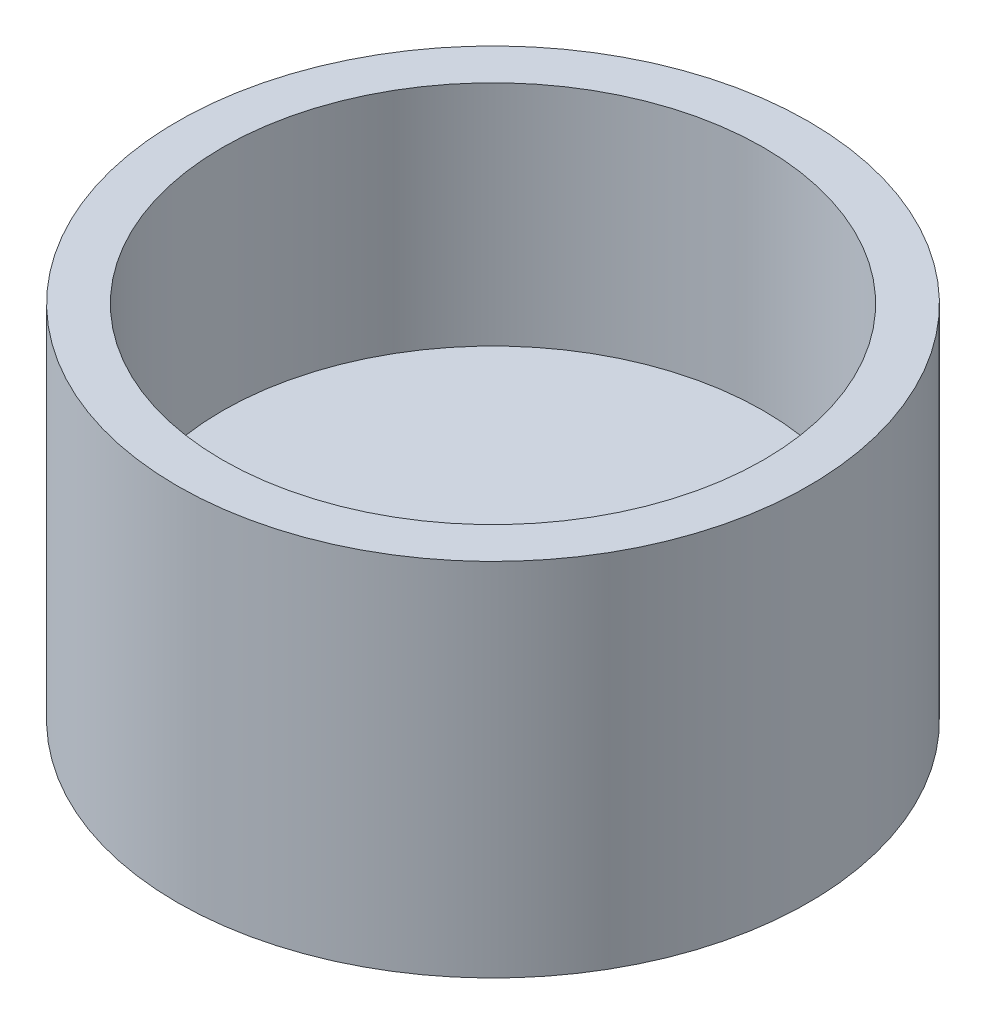
ISO-10303-21;
HEADER;
FILE_DESCRIPTION(('STEP AP214'),'2;1');
FILE_NAME('part.step','',(''),(''),'','','');
FILE_SCHEMA(('AUTOMOTIVE_DESIGN { 1 0 10303 214 1 1 1 1 }'));
ENDSEC;
DATA;
#1=APPLICATION_CONTEXT('core data for automotive mechanical design processes');
#2=APPLICATION_PROTOCOL_DEFINITION('international standard','automotive_design',2000,#1);
#3=PRODUCT_CONTEXT('',#1,'mechanical');
#4=PRODUCT('Part','Part','',(#3));
#5=PRODUCT_RELATED_PRODUCT_CATEGORY('part','',(#4));
#6=PRODUCT_DEFINITION_FORMATION('','',#4);
#7=PRODUCT_DEFINITION_CONTEXT('part definition',#1,'design');
#8=PRODUCT_DEFINITION('design','',#6,#7);
#9=PRODUCT_DEFINITION_SHAPE('','',#8);
#10=(LENGTH_UNIT() NAMED_UNIT(*) SI_UNIT(.MILLI.,.METRE.));
#11=(NAMED_UNIT(*) PLANE_ANGLE_UNIT() SI_UNIT($,.RADIAN.));
#12=(NAMED_UNIT(*) SI_UNIT($,.STERADIAN.) SOLID_ANGLE_UNIT());
#13=UNCERTAINTY_MEASURE_WITH_UNIT(LENGTH_MEASURE(1.E-05),#10,'distance_accuracy_value','');
#14=(GEOMETRIC_REPRESENTATION_CONTEXT(3) GLOBAL_UNCERTAINTY_ASSIGNED_CONTEXT((#13)) GLOBAL_UNIT_ASSIGNED_CONTEXT((#10,
#11,#12)) REPRESENTATION_CONTEXT('',''));
#15=CARTESIAN_POINT('',(0.,0.,0.));
#16=DIRECTION('',(0.,0.,1.));
#17=DIRECTION('',(1.,0.,0.));
#18=AXIS2_PLACEMENT_3D('',#15,#16,#17);
#19=CARTESIAN_POINT('',(0.,0.,0.));
#20=DIRECTION('',(0.,1.,0.));
#21=DIRECTION('',(0.,0.,1.));
#22=AXIS2_PLACEMENT_3D('',#19,#20,#21);
#23=PLANE('',#22);
#24=CARTESIAN_POINT('',(0.,0.,0.));
#25=DIRECTION('',(0.,1.,0.));
#26=DIRECTION('',(0.,0.,1.));
#27=AXIS2_PLACEMENT_3D('',#24,#25,#26);
#28=CIRCLE('',#27,22.225);
#29=CARTESIAN_POINT('',(0.,0.,22.225));
#30=VERTEX_POINT('',#29);
#31=EDGE_CURVE('E45',#30,#30,#28,.T.);
#32=ORIENTED_EDGE('',*,*,#31,.F.);
#33=EDGE_LOOP('',(#32));
#34=FACE_BOUND('',#33,.T.);
#35=DIRECTION('',(-0.452258165067834,0.,-0.89188707364188));
#36=VECTOR('',#35,1.);
#37=CARTESIAN_POINT('',(8.6474883524025,0.,0.470048077395396));
#38=LINE('',#37,#36);
#39=CARTESIAN_POINT('',(8.6474883524025,0.,0.470048077395397));
#40=VERTEX_POINT('',#39);
#41=CARTESIAN_POINT('',(4.7308177522257,0.,-7.2539205534129));
#42=VERTEX_POINT('',#41);
#43=EDGE_CURVE('E52',#40,#42,#38,.T.);
#44=ORIENTED_EDGE('',*,*,#43,.T.);
#45=DIRECTION('',(-0.998525945614747,0.,-0.0542764768032601));
#46=VECTOR('',#45,1.);
#47=CARTESIAN_POINT('',(4.7308177522257,0.,-7.2539205534129));
#48=LINE('',#47,#46);
#49=CARTESIAN_POINT('',(-3.9166706001768,0.,-7.7239686308083));
#50=VERTEX_POINT('',#49);
#51=EDGE_CURVE('E111',#42,#50,#48,.T.);
#52=ORIENTED_EDGE('',*,*,#51,.T.);
#53=DIRECTION('',(-0.546267780546913,0.,0.83761059683862));
#54=VECTOR('',#53,1.);
#55=CARTESIAN_POINT('',(-3.9166706001768,0.,-7.7239686308083));
#56=LINE('',#55,#54);
#57=CARTESIAN_POINT('',(-8.6474883524025,0.,-0.470048077395396));
#58=VERTEX_POINT('',#57);
#59=EDGE_CURVE('E109',#50,#58,#56,.T.);
#60=ORIENTED_EDGE('',*,*,#59,.T.);
#61=DIRECTION('',(0.452258165067834,0.,0.89188707364188));
#62=VECTOR('',#61,1.);
#63=CARTESIAN_POINT('',(-8.6474883524025,0.,-0.470048077395396));
#64=LINE('',#63,#62);
#65=CARTESIAN_POINT('',(-4.7308177522257,0.,7.25392055341291));
#66=VERTEX_POINT('',#65);
#67=EDGE_CURVE('E88',#58,#66,#64,.T.);
#68=ORIENTED_EDGE('',*,*,#67,.T.);
#69=DIRECTION('',(0.998525945614747,0.,0.0542764768032597));
#70=VECTOR('',#69,1.);
#71=CARTESIAN_POINT('',(-4.7308177522257,0.,7.25392055341291));
#72=LINE('',#71,#70);
#73=CARTESIAN_POINT('',(3.9166706001768,0.,7.7239686308083));
#74=VERTEX_POINT('',#73);
#75=EDGE_CURVE('E99',#66,#74,#72,.T.);
#76=ORIENTED_EDGE('',*,*,#75,.T.);
#77=DIRECTION('',(0.546267780546913,0.,-0.83761059683862));
#78=VECTOR('',#77,1.);
#79=CARTESIAN_POINT('',(3.9166706001768,0.,7.7239686308083));
#80=LINE('',#79,#78);
#81=EDGE_CURVE('E105',#74,#40,#80,.T.);
#82=ORIENTED_EDGE('',*,*,#81,.T.);
#83=EDGE_LOOP('',(#44,#52,#60,#68,#76,#82));
#84=FACE_BOUND('',#83,.T.);
#85=ADVANCED_FACE('F37',(#34,#84),#23,.F.);
#86=CARTESIAN_POINT('',(0.,6.35,0.));
#87=DIRECTION('',(0.,-1.,0.));
#88=DIRECTION('',(0.,0.,-1.));
#89=AXIS2_PLACEMENT_3D('',#86,#87,#88);
#90=CYLINDRICAL_SURFACE('',#89,22.225);
#91=ORIENTED_EDGE('',*,*,#31,.T.);
#92=EDGE_LOOP('',(#91));
#93=FACE_BOUND('',#92,.T.);
#94=CARTESIAN_POINT('',(0.,25.4,0.));
#95=DIRECTION('',(0.,1.,0.));
#96=DIRECTION('',(0.,0.,1.));
#97=AXIS2_PLACEMENT_3D('',#94,#95,#96);
#98=CIRCLE('',#97,22.225);
#99=CARTESIAN_POINT('',(0.,25.4,22.225));
#100=VERTEX_POINT('',#99);
#101=EDGE_CURVE('E187',#100,#100,#98,.T.);
#102=ORIENTED_EDGE('',*,*,#101,.F.);
#103=EDGE_LOOP('',(#102));
#104=FACE_BOUND('',#103,.T.);
#105=ADVANCED_FACE('F39',(#93,#104),#90,.T.);
#106=CARTESIAN_POINT('',(8.6474883524025,6.35,0.470048077395396));
#107=DIRECTION('',(-0.89188707364188,0.,0.452258165067834));
#108=DIRECTION('',(0.452258165067834,0.,0.89188707364188));
#109=AXIS2_PLACEMENT_3D('',#106,#107,#108);
#110=PLANE('',#109);
#111=ORIENTED_EDGE('',*,*,#43,.F.);
#112=DIRECTION('',(0.,-1.,0.));
#113=VECTOR('',#112,1.);
#114=CARTESIAN_POINT('',(8.6474883524025,6.35,0.470048077395396));
#115=LINE('',#114,#113);
#116=CARTESIAN_POINT('',(8.6474883524025,6.35,0.470048077395396));
#117=VERTEX_POINT('',#116);
#118=EDGE_CURVE('E116',#117,#40,#115,.T.);
#119=ORIENTED_EDGE('',*,*,#118,.F.);
#120=DIRECTION('',(-0.452258165067834,0.,-0.89188707364188));
#121=VECTOR('',#120,1.);
#122=CARTESIAN_POINT('',(8.6474883524025,6.35,0.470048077395396));
#123=LINE('',#122,#121);
#124=CARTESIAN_POINT('',(4.7308177522257,6.35,-7.2539205534129));
#125=VERTEX_POINT('',#124);
#126=EDGE_CURVE('E61',#117,#125,#123,.T.);
#127=ORIENTED_EDGE('',*,*,#126,.T.);
#128=DIRECTION('',(0.,-1.,0.));
#129=VECTOR('',#128,1.);
#130=CARTESIAN_POINT('',(4.7308177522257,6.35,-7.2539205534129));
#131=LINE('',#130,#129);
#132=EDGE_CURVE('E123',#125,#42,#131,.T.);
#133=ORIENTED_EDGE('',*,*,#132,.T.);
#134=EDGE_LOOP('',(#111,#119,#127,#133));
#135=FACE_BOUND('',#134,.T.);
#136=ADVANCED_FACE('F133',(#135),#110,.T.);
#137=CARTESIAN_POINT('',(4.7308177522257,6.35,-7.2539205534129));
#138=DIRECTION('',(-0.0542764768032601,0.,0.998525945614747));
#139=DIRECTION('',(0.998525945614747,0.,0.0542764768032601));
#140=AXIS2_PLACEMENT_3D('',#137,#138,#139);
#141=PLANE('',#140);
#142=ORIENTED_EDGE('',*,*,#51,.F.);
#143=ORIENTED_EDGE('',*,*,#132,.F.);
#144=DIRECTION('',(-0.998525945614747,0.,-0.0542764768032601));
#145=VECTOR('',#144,1.);
#146=CARTESIAN_POINT('',(4.7308177522257,6.35,-7.2539205534129));
#147=LINE('',#146,#145);
#148=CARTESIAN_POINT('',(-3.9166706001768,6.35,-7.7239686308083));
#149=VERTEX_POINT('',#148);
#150=EDGE_CURVE('E191',#125,#149,#147,.T.);
#151=ORIENTED_EDGE('',*,*,#150,.T.);
#152=DIRECTION('',(0.,-1.,0.));
#153=VECTOR('',#152,1.);
#154=CARTESIAN_POINT('',(-3.9166706001768,6.35,-7.7239686308083));
#155=LINE('',#154,#153);
#156=EDGE_CURVE('E121',#149,#50,#155,.T.);
#157=ORIENTED_EDGE('',*,*,#156,.T.);
#158=EDGE_LOOP('',(#142,#143,#151,#157));
#159=FACE_BOUND('',#158,.T.);
#160=ADVANCED_FACE('F137',(#159),#141,.T.);
#161=CARTESIAN_POINT('',(-3.9166706001768,6.35,-7.7239686308083));
#162=DIRECTION('',(0.83761059683862,0.,0.546267780546913));
#163=DIRECTION('',(0.546267780546913,0.,-0.83761059683862));
#164=AXIS2_PLACEMENT_3D('',#161,#162,#163);
#165=PLANE('',#164);
#166=ORIENTED_EDGE('',*,*,#59,.F.);
#167=ORIENTED_EDGE('',*,*,#156,.F.);
#168=DIRECTION('',(-0.546267780546913,0.,0.83761059683862));
#169=VECTOR('',#168,1.);
#170=CARTESIAN_POINT('',(-3.9166706001768,6.35,-7.7239686308083));
#171=LINE('',#170,#169);
#172=CARTESIAN_POINT('',(-8.6474883524025,6.35,-0.470048077395396));
#173=VERTEX_POINT('',#172);
#174=EDGE_CURVE('E194',#149,#173,#171,.T.);
#175=ORIENTED_EDGE('',*,*,#174,.T.);
#176=DIRECTION('',(0.,-1.,0.));
#177=VECTOR('',#176,1.);
#178=CARTESIAN_POINT('',(-8.6474883524025,6.35,-0.470048077395396));
#179=LINE('',#178,#177);
#180=EDGE_CURVE('E95',#173,#58,#179,.T.);
#181=ORIENTED_EDGE('',*,*,#180,.T.);
#182=EDGE_LOOP('',(#166,#167,#175,#181));
#183=FACE_BOUND('',#182,.T.);
#184=ADVANCED_FACE('F140',(#183),#165,.T.);
#185=CARTESIAN_POINT('',(-8.6474883524025,6.35,-0.470048077395396));
#186=DIRECTION('',(0.89188707364188,0.,-0.452258165067834));
#187=DIRECTION('',(-0.452258165067834,0.,-0.89188707364188));
#188=AXIS2_PLACEMENT_3D('',#185,#186,#187);
#189=PLANE('',#188);
#190=ORIENTED_EDGE('',*,*,#67,.F.);
#191=ORIENTED_EDGE('',*,*,#180,.F.);
#192=DIRECTION('',(0.452258165067834,0.,0.89188707364188));
#193=VECTOR('',#192,1.);
#194=CARTESIAN_POINT('',(-8.6474883524025,6.35,-0.470048077395396));
#195=LINE('',#194,#193);
#196=CARTESIAN_POINT('',(-4.7308177522257,6.35,7.25392055341291));
#197=VERTEX_POINT('',#196);
#198=EDGE_CURVE('E92',#173,#197,#195,.T.);
#199=ORIENTED_EDGE('',*,*,#198,.T.);
#200=DIRECTION('',(0.,-1.,0.));
#201=VECTOR('',#200,1.);
#202=CARTESIAN_POINT('',(-4.7308177522257,6.35,7.25392055341291));
#203=LINE('',#202,#201);
#204=EDGE_CURVE('E83',#197,#66,#203,.T.);
#205=ORIENTED_EDGE('',*,*,#204,.T.);
#206=EDGE_LOOP('',(#190,#191,#199,#205));
#207=FACE_BOUND('',#206,.T.);
#208=ADVANCED_FACE('F85',(#207),#189,.T.);
#209=CARTESIAN_POINT('',(-4.7308177522257,6.35,7.25392055341291));
#210=DIRECTION('',(0.0542764768032597,0.,-0.998525945614747));
#211=DIRECTION('',(-0.998525945614747,0.,-0.0542764768032597));
#212=AXIS2_PLACEMENT_3D('',#209,#210,#211);
#213=PLANE('',#212);
#214=ORIENTED_EDGE('',*,*,#75,.F.);
#215=ORIENTED_EDGE('',*,*,#204,.F.);
#216=DIRECTION('',(0.998525945614747,0.,0.0542764768032597));
#217=VECTOR('',#216,1.);
#218=CARTESIAN_POINT('',(-4.7308177522257,6.35,7.25392055341291));
#219=LINE('',#218,#217);
#220=CARTESIAN_POINT('',(3.9166706001768,6.35,7.7239686308083));
#221=VERTEX_POINT('',#220);
#222=EDGE_CURVE('E198',#197,#221,#219,.T.);
#223=ORIENTED_EDGE('',*,*,#222,.T.);
#224=DIRECTION('',(0.,-1.,0.));
#225=VECTOR('',#224,1.);
#226=CARTESIAN_POINT('',(3.9166706001768,6.35,7.7239686308083));
#227=LINE('',#226,#225);
#228=EDGE_CURVE('E96',#221,#74,#227,.T.);
#229=ORIENTED_EDGE('',*,*,#228,.T.);
#230=EDGE_LOOP('',(#214,#215,#223,#229));
#231=FACE_BOUND('',#230,.T.);
#232=ADVANCED_FACE('F100',(#231),#213,.T.);
#233=CARTESIAN_POINT('',(3.9166706001768,6.35,7.7239686308083));
#234=DIRECTION('',(-0.83761059683862,0.,-0.546267780546913));
#235=DIRECTION('',(-0.546267780546913,0.,0.83761059683862));
#236=AXIS2_PLACEMENT_3D('',#233,#234,#235);
#237=PLANE('',#236);
#238=ORIENTED_EDGE('',*,*,#81,.F.);
#239=ORIENTED_EDGE('',*,*,#228,.F.);
#240=DIRECTION('',(0.546267780546913,0.,-0.83761059683862));
#241=VECTOR('',#240,1.);
#242=CARTESIAN_POINT('',(3.9166706001768,6.35,7.7239686308083));
#243=LINE('',#242,#241);
#244=EDGE_CURVE('E118',#221,#117,#243,.T.);
#245=ORIENTED_EDGE('',*,*,#244,.T.);
#246=ORIENTED_EDGE('',*,*,#118,.T.);
#247=EDGE_LOOP('',(#238,#239,#245,#246));
#248=FACE_BOUND('',#247,.T.);
#249=ADVANCED_FACE('F149',(#248),#237,.T.);
#250=CARTESIAN_POINT('',(0.,25.4,0.));
#251=DIRECTION('',(0.,1.,0.));
#252=DIRECTION('',(0.,0.,1.));
#253=AXIS2_PLACEMENT_3D('',#250,#251,#252);
#254=PLANE('',#253);
#255=ORIENTED_EDGE('',*,*,#101,.T.);
#256=EDGE_LOOP('',(#255));
#257=FACE_BOUND('',#256,.T.);
#258=CARTESIAN_POINT('',(0.,25.4,0.));
#259=DIRECTION('',(0.,1.,0.));
#260=DIRECTION('',(0.,0.,1.));
#261=AXIS2_PLACEMENT_3D('',#258,#259,#260);
#262=CIRCLE('',#261,19.05);
#263=CARTESIAN_POINT('',(0.,25.4,19.05));
#264=VERTEX_POINT('',#263);
#265=EDGE_CURVE('E182',#264,#264,#262,.T.);
#266=ORIENTED_EDGE('',*,*,#265,.F.);
#267=EDGE_LOOP('',(#266));
#268=FACE_BOUND('',#267,.T.);
#269=ADVANCED_FACE('F152',(#257,#268),#254,.T.);
#270=CARTESIAN_POINT('',(0.,25.4,0.));
#271=DIRECTION('',(0.,-1.,0.));
#272=DIRECTION('',(0.,0.,-1.));
#273=AXIS2_PLACEMENT_3D('',#270,#271,#272);
#274=CYLINDRICAL_SURFACE('',#273,19.05);
#275=CARTESIAN_POINT('',(0.,9.35,0.));
#276=DIRECTION('',(0.,1.,0.));
#277=DIRECTION('',(0.,0.,1.));
#278=AXIS2_PLACEMENT_3D('',#275,#276,#277);
#279=CIRCLE('',#278,19.05);
#280=CARTESIAN_POINT('',(0.,9.35,19.05));
#281=VERTEX_POINT('',#280);
#282=EDGE_CURVE('E11',#281,#281,#279,.T.);
#283=ORIENTED_EDGE('',*,*,#282,.F.);
#284=EDGE_LOOP('',(#283));
#285=FACE_BOUND('',#284,.T.);
#286=ORIENTED_EDGE('',*,*,#265,.T.);
#287=EDGE_LOOP('',(#286));
#288=FACE_BOUND('',#287,.T.);
#289=ADVANCED_FACE('F156',(#285,#288),#274,.F.);
#290=CARTESIAN_POINT('',(0.,9.35,0.));
#291=DIRECTION('',(0.,1.,0.));
#292=DIRECTION('',(0.,0.,1.));
#293=AXIS2_PLACEMENT_3D('',#290,#291,#292);
#294=PLANE('',#293);
#295=ORIENTED_EDGE('',*,*,#282,.T.);
#296=EDGE_LOOP('',(#295));
#297=FACE_BOUND('',#296,.T.);
#298=CARTESIAN_POINT('',(0.,9.35,0.));
#299=DIRECTION('',(0.,1.,0.));
#300=DIRECTION('',(0.,0.,1.));
#301=AXIS2_PLACEMENT_3D('',#298,#299,#300);
#302=CIRCLE('',#301,2.75);
#303=CARTESIAN_POINT('',(0.,9.35,2.75));
#304=VERTEX_POINT('',#303);
#305=EDGE_CURVE('E176',#304,#304,#302,.T.);
#306=ORIENTED_EDGE('',*,*,#305,.F.);
#307=EDGE_LOOP('',(#306));
#308=FACE_BOUND('',#307,.T.);
#309=ADVANCED_FACE('F160',(#297,#308),#294,.T.);
#310=CARTESIAN_POINT('',(0.,6.35,0.));
#311=DIRECTION('',(0.,1.,0.));
#312=DIRECTION('',(0.,0.,1.));
#313=AXIS2_PLACEMENT_3D('',#310,#311,#312);
#314=PLANE('',#313);
#315=ORIENTED_EDGE('',*,*,#126,.F.);
#316=ORIENTED_EDGE('',*,*,#244,.F.);
#317=ORIENTED_EDGE('',*,*,#222,.F.);
#318=ORIENTED_EDGE('',*,*,#198,.F.);
#319=ORIENTED_EDGE('',*,*,#174,.F.);
#320=ORIENTED_EDGE('',*,*,#150,.F.);
#321=EDGE_LOOP('',(#315,#316,#317,#318,#319,#320));
#322=FACE_BOUND('',#321,.T.);
#323=CARTESIAN_POINT('',(0.,6.35,0.));
#324=DIRECTION('',(0.,1.,0.));
#325=DIRECTION('',(0.,0.,1.));
#326=AXIS2_PLACEMENT_3D('',#323,#324,#325);
#327=CIRCLE('',#326,2.75);
#328=CARTESIAN_POINT('',(0.,6.35,2.75));
#329=VERTEX_POINT('',#328);
#330=EDGE_CURVE('E179',#329,#329,#327,.T.);
#331=ORIENTED_EDGE('',*,*,#330,.T.);
#332=EDGE_LOOP('',(#331));
#333=FACE_BOUND('',#332,.T.);
#334=ADVANCED_FACE('F162',(#322,#333),#314,.F.);
#335=CARTESIAN_POINT('',(0.,9.35,0.));
#336=DIRECTION('',(0.,-1.,0.));
#337=DIRECTION('',(0.,0.,-1.));
#338=AXIS2_PLACEMENT_3D('',#335,#336,#337);
#339=CYLINDRICAL_SURFACE('',#338,2.75);
#340=ORIENTED_EDGE('',*,*,#305,.T.);
#341=EDGE_LOOP('',(#340));
#342=FACE_BOUND('',#341,.T.);
#343=ORIENTED_EDGE('',*,*,#330,.F.);
#344=EDGE_LOOP('',(#343));
#345=FACE_BOUND('',#344,.T.);
#346=ADVANCED_FACE('F165',(#342,#345),#339,.F.);
#347=CLOSED_SHELL('',(#85,#105,#136,#160,#184,#208,#232,#249,#269,#289,#309,#334,#346));
#348=MANIFOLD_SOLID_BREP('B2',#347);
#349=ADVANCED_BREP_SHAPE_REPRESENTATION('',(#18,#348),#14);
#350=SHAPE_DEFINITION_REPRESENTATION(#9,#349);
ENDSEC;
END-ISO-10303-21;
